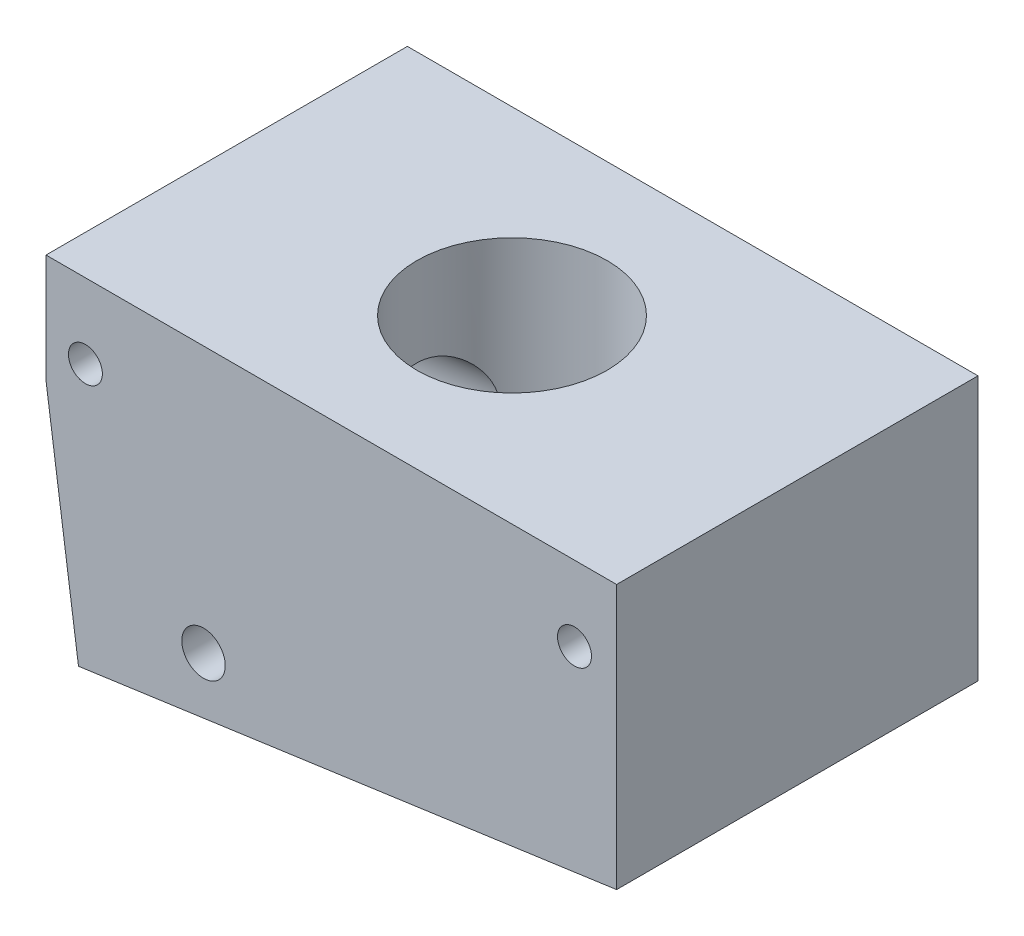
ISO-10303-21;
HEADER;
FILE_DESCRIPTION(('STEP AP214'),'2;1');
FILE_NAME('part.step','',(''),(''),'','','');
FILE_SCHEMA(('AUTOMOTIVE_DESIGN { 1 0 10303 214 1 1 1 1 }'));
ENDSEC;
DATA;
#1=APPLICATION_CONTEXT('core data for automotive mechanical design processes');
#2=APPLICATION_PROTOCOL_DEFINITION('international standard','automotive_design',2000,#1);
#3=PRODUCT_CONTEXT('',#1,'mechanical');
#4=PRODUCT('Part','Part','',(#3));
#5=PRODUCT_RELATED_PRODUCT_CATEGORY('part','',(#4));
#6=PRODUCT_DEFINITION_FORMATION('','',#4);
#7=PRODUCT_DEFINITION_CONTEXT('part definition',#1,'design');
#8=PRODUCT_DEFINITION('design','',#6,#7);
#9=PRODUCT_DEFINITION_SHAPE('','',#8);
#10=(LENGTH_UNIT() NAMED_UNIT(*) SI_UNIT(.MILLI.,.METRE.));
#11=(NAMED_UNIT(*) PLANE_ANGLE_UNIT() SI_UNIT($,.RADIAN.));
#12=(NAMED_UNIT(*) SI_UNIT($,.STERADIAN.) SOLID_ANGLE_UNIT());
#13=UNCERTAINTY_MEASURE_WITH_UNIT(LENGTH_MEASURE(1.E-05),#10,'distance_accuracy_value','');
#14=(GEOMETRIC_REPRESENTATION_CONTEXT(3) GLOBAL_UNCERTAINTY_ASSIGNED_CONTEXT((#13)) GLOBAL_UNIT_ASSIGNED_CONTEXT((#10,
#11,#12)) REPRESENTATION_CONTEXT('',''));
#15=CARTESIAN_POINT('',(0.,0.,0.));
#16=DIRECTION('',(0.,0.,1.));
#17=DIRECTION('',(1.,0.,0.));
#18=AXIS2_PLACEMENT_3D('',#15,#16,#17);
#19=CARTESIAN_POINT('',(-70.6449450864006,-20.1462402080981,13.3));
#20=DIRECTION('',(-0.990268068741571,-0.139173100960062,0.));
#21=DIRECTION('',(0.139173100960062,-0.990268068741571,0.));
#22=AXIS2_PLACEMENT_3D('',#19,#20,#21);
#23=CYLINDRICAL_SURFACE('',#22,4.49999999999999);
#24=CARTESIAN_POINT('',(-70.6449450864006,-20.1462402080981,13.3));
#25=DIRECTION('',(-0.990268068741571,-0.139173100960062,0.));
#26=DIRECTION('',(0.139173100960062,-0.990268068741571,0.));
#27=AXIS2_PLACEMENT_3D('',#24,#25,#26);
#28=CIRCLE('',#27,4.49999999999999);
#29=CARTESIAN_POINT('',(-70.0186661320803,-24.6024465174351,13.3));
#30=VERTEX_POINT('',#29);
#31=EDGE_CURVE('E211',#30,#30,#28,.T.);
#32=ORIENTED_EDGE('',*,*,#31,.T.);
#33=EDGE_LOOP('',(#32));
#34=FACE_BOUND('',#33,.T.);
#35=CARTESIAN_POINT('',(-61.7951592287187,-23.4467079930558,13.3));
#36=CARTESIAN_POINT('',(-61.7951604435383,-23.4467095598353,13.4088646906607));
#37=CARTESIAN_POINT('',(-61.7926143042912,-23.4423556324085,13.5177143788517));
#38=CARTESIAN_POINT('',(-61.782502355978,-23.4250257901873,13.734527313487));
#39=CARTESIAN_POINT('',(-61.7749349747786,-23.4120471750315,13.842490271578));
#40=CARTESIAN_POINT('',(-61.7549691167927,-23.3776828591857,14.0567219517486));
#41=CARTESIAN_POINT('',(-61.7425659372059,-23.3562889744895,14.162988919444));
#42=CARTESIAN_POINT('',(-61.713252046352,-23.3054697683965,14.3729663779708));
#43=CARTESIAN_POINT('',(-61.6963393445591,-23.2760409001796,14.4766757177134));
#44=CARTESIAN_POINT('',(-61.6396733021754,-23.1768044344509,14.7815653120615));
#45=CARTESIAN_POINT('',(-61.5938356782872,-23.0957841711633,14.9780859292963));
#46=CARTESIAN_POINT('',(-61.4897368663304,-22.9079478026812,15.3544861292814));
#47=CARTESIAN_POINT('',(-61.4314745969379,-22.8011294521575,15.534364261672));
#48=CARTESIAN_POINT('',(-61.3003810293889,-22.5538968437765,15.8926762300728));
#49=CARTESIAN_POINT('',(-61.2266789577439,-22.4112056961031,16.0692105664642));
#50=CARTESIAN_POINT('',(-61.0743423269966,-22.1032559194024,16.399182204132));
#51=CARTESIAN_POINT('',(-60.9957024740817,-21.9379728381855,16.5525940954574));
#52=CARTESIAN_POINT('',(-60.869670333559,-21.656554344579,16.779941417782));
#53=CARTESIAN_POINT('',(-60.822103030141,-21.5465244236298,16.861471262419));
#54=CARTESIAN_POINT('',(-60.7283993228048,-21.3196585935818,17.0154787295046));
#55=CARTESIAN_POINT('',(-60.6822632302036,-21.2028212194143,17.0879543927229));
#56=CARTESIAN_POINT('',(-60.5928244349399,-20.9628225160916,17.2234766393125));
#57=CARTESIAN_POINT('',(-60.5495204556348,-20.8396640816172,17.2865274878532));
#58=CARTESIAN_POINT('',(-60.4672235259846,-20.5874036524258,17.402774072952));
#59=CARTESIAN_POINT('',(-60.4282313095296,-20.4583006511852,17.4559681328583));
#60=CARTESIAN_POINT('',(-60.3366512824252,-20.1229205318468,17.5779042040824));
#61=CARTESIAN_POINT('',(-60.2881472931658,-19.9127367493303,17.6394494608499));
#62=CARTESIAN_POINT('',(-60.2309215762563,-19.5903345561735,17.7106005313251));
#63=CARTESIAN_POINT('',(-60.2144372607735,-19.4817121238631,17.730786947981));
#64=CARTESIAN_POINT('',(-60.1873496212365,-19.2626301698351,17.7637141907257));
#65=CARTESIAN_POINT('',(-60.1767436470567,-19.1521714991186,17.7764583721279));
#66=CARTESIAN_POINT('',(-60.1619419227022,-18.9291668583866,17.794194026826));
#67=CARTESIAN_POINT('',(-60.1578062232669,-18.816611033034,17.7991128801071));
#68=CARTESIAN_POINT('',(-60.1565015929565,-18.5913921997807,17.8006677973157));
#69=CARTESIAN_POINT('',(-60.1593325471758,-18.4787291936784,17.7973039978543));
#70=CARTESIAN_POINT('',(-60.1720057009548,-18.2543747823547,17.7821444181708));
#71=CARTESIAN_POINT('',(-60.1818474986015,-18.1426833218085,17.7703491213038));
#72=CARTESIAN_POINT('',(-60.2082348555533,-17.9213226439936,17.7383600887269));
#73=CARTESIAN_POINT('',(-60.224780061647,-17.811653320494,17.718166795517));
#74=CARTESIAN_POINT('',(-60.2615191388135,-17.6087144109905,17.6726022436824));
#75=CARTESIAN_POINT('',(-60.2810048080834,-17.5150994417144,17.6481853426758));
#76=CARTESIAN_POINT('',(-60.3240823289037,-17.3306244048042,17.5932769722023));
#77=CARTESIAN_POINT('',(-60.3476755157693,-17.2397652443714,17.5627835268406));
#78=CARTESIAN_POINT('',(-60.4236754578473,-16.97195907053,17.4625511856442));
#79=CARTESIAN_POINT('',(-60.481318963467,-16.7996981388874,17.384040916594));
#80=CARTESIAN_POINT('',(-60.6117602673321,-16.4524247578802,17.1963489167592));
#81=CARTESIAN_POINT('',(-60.6855190076381,-16.2790828081493,17.0847871800578));
#82=CARTESIAN_POINT('',(-60.8368924711959,-15.9517433721302,16.838132737509));
#83=CARTESIAN_POINT('',(-60.9145096607689,-15.7977584866393,16.7030248390458));
#84=CARTESIAN_POINT('',(-61.0366786172912,-15.5687442317799,16.4706567507527));
#85=CARTESIAN_POINT('',(-61.0818873966835,-15.4870003547944,16.3802372959811));
#86=CARTESIAN_POINT('',(-61.1705380217256,-15.331095020132,16.1922870712441));
#87=CARTESIAN_POINT('',(-61.2139803343102,-15.2569315507568,16.0947581998168));
#88=CARTESIAN_POINT('',(-61.298120242607,-15.1164615176993,15.8929636668466));
#89=CARTESIAN_POINT('',(-61.3388157988787,-15.0501607649512,15.7886931097253));
#90=CARTESIAN_POINT('',(-61.4164705650532,-14.9258863240237,15.5740393019983));
#91=CARTESIAN_POINT('',(-61.453431451866,-14.8679088936107,15.463658829586));
#92=CARTESIAN_POINT('',(-61.5235945035398,-14.759384512484,15.2346420683274));
#93=CARTESIAN_POINT('',(-61.5566856314013,-14.7090484357518,15.115871466798));
#94=CARTESIAN_POINT('',(-61.6171943645121,-14.6180015601282,14.873354984208));
#95=CARTESIAN_POINT('',(-61.644614533393,-14.5772864107781,14.7496113816068));
#96=CARTESIAN_POINT('',(-61.693053768082,-14.5059173395687,14.4980993854212));
#97=CARTESIAN_POINT('',(-61.714076163486,-14.4752581836164,14.3703331236875));
#98=CARTESIAN_POINT('',(-61.7491493950522,-14.4243582855182,14.1118062351339));
#99=CARTESIAN_POINT('',(-61.7632010983426,-14.4041162475096,13.9810459828735));
#100=CARTESIAN_POINT('',(-61.7828749808254,-14.3758403834713,13.7311629443279));
#101=CARTESIAN_POINT('',(-61.7892101736357,-14.3667727950232,13.6122119356744));
#102=CARTESIAN_POINT('',(-61.7957856625716,-14.3573621004427,13.3737998058631));
#103=CARTESIAN_POINT('',(-61.7960263465884,-14.3570184390672,13.2543387176539));
#104=CARTESIAN_POINT('',(-61.7904074296577,-14.3650587120021,13.0158795619416));
#105=CARTESIAN_POINT('',(-61.7845489924966,-14.373440981299,12.8968814104527));
#106=CARTESIAN_POINT('',(-61.7668742274746,-14.3988319521068,12.6602601094373));
#107=CARTESIAN_POINT('',(-61.7550579530776,-14.4158405762072,12.5426369475817));
#108=CARTESIAN_POINT('',(-61.7264940198362,-14.4572083679251,12.3156202520235));
#109=CARTESIAN_POINT('',(-61.7100301768613,-14.4811460775256,12.2061139232732));
#110=CARTESIAN_POINT('',(-61.6723292734832,-14.5363915896355,11.9898051160891));
#111=CARTESIAN_POINT('',(-61.6510906838288,-14.56770175354,11.8830035161438));
#112=CARTESIAN_POINT('',(-61.5808275200311,-14.6722964441462,11.5676799003671));
#113=CARTESIAN_POINT('',(-61.5252298847725,-14.7562812348267,11.3640434350038));
#114=CARTESIAN_POINT('',(-61.3968601270556,-14.9563166516566,10.9623123822942));
#115=CARTESIAN_POINT('',(-61.3232455149178,-15.0740144088316,10.7653186341956));
#116=CARTESIAN_POINT('',(-61.1667048516884,-15.3364343952181,10.3941394184212));
#117=CARTESIAN_POINT('',(-61.0837693469619,-15.4811841621214,10.2199775026289));
#118=CARTESIAN_POINT('',(-60.9065063778418,-15.8120420226377,9.88068353468433));
#119=CARTESIAN_POINT('',(-60.8118883844101,-16.0008803300557,9.71835262065687));
#120=CARTESIAN_POINT('',(-60.6299259471343,-16.4069614209923,9.42899378796106));
#121=CARTESIAN_POINT('',(-60.5425744552945,-16.6241761429677,9.30193137501221));
#122=CARTESIAN_POINT('',(-60.4043184048102,-17.03432569713,9.11094607893179));
#123=CARTESIAN_POINT('',(-60.3496173715876,-17.2223395723906,9.03930963033842));
#124=CARTESIAN_POINT('',(-60.2812759507209,-17.5134305945277,8.952142015136));
#125=CARTESIAN_POINT('',(-60.260783091858,-17.6119530482325,8.92647027275395));
#126=CARTESIAN_POINT('',(-60.2249769759887,-17.8114624572079,8.88209343285216));
#127=CARTESIAN_POINT('',(-60.2096617061445,-17.9124484383504,8.86338562774793));
#128=CARTESIAN_POINT('',(-60.1846449601877,-18.1166028013696,8.83302864526773));
#129=CARTESIAN_POINT('',(-60.1749673281648,-18.2197785670061,8.82140943910098));
#130=CARTESIAN_POINT('',(-60.1615899876142,-18.4270727340516,8.8053887685724));
#131=CARTESIAN_POINT('',(-60.1578902689594,-18.5311911338635,8.80098729198301));
#132=CARTESIAN_POINT('',(-60.1564826561877,-18.7395499359277,8.79930961433673));
#133=CARTESIAN_POINT('',(-60.1587762301103,-18.8437903618188,8.80203515902297));
#134=CARTESIAN_POINT('',(-60.1691150599204,-19.05158706797,8.81439485648143));
#135=CARTESIAN_POINT('',(-60.1771626736434,-19.1551430502034,8.82403184136252));
#136=CARTESIAN_POINT('',(-60.2082852286066,-19.453716109813,8.86162769078791));
#137=CARTESIAN_POINT('',(-60.238367178427,-19.6469906290363,8.89827207249072));
#138=CARTESIAN_POINT('',(-60.3137127527436,-20.0249156833404,8.99312383098931));
#139=CARTESIAN_POINT('',(-60.3589879324181,-20.2095595322413,9.05134762349097));
#140=CARTESIAN_POINT('',(-60.4852363674552,-20.6572474282288,9.22090927036609));
#141=CARTESIAN_POINT('',(-60.5727972319848,-20.9139790957858,9.34427751762735));
#142=CARTESIAN_POINT('',(-60.7119287081042,-21.278645909727,9.55845464781436));
#143=CARTESIAN_POINT('',(-60.7596836212332,-21.3969623872555,9.63484102169131));
#144=CARTESIAN_POINT('',(-60.8564156616094,-21.6264035498107,9.79713306140822));
#145=CARTESIAN_POINT('',(-60.9053926363982,-21.7375291257845,9.88303754437082));
#146=CARTESIAN_POINT('',(-61.0037485612911,-21.9532016993386,10.0651500891634));
#147=CARTESIAN_POINT('',(-61.0531258446877,-22.0576607497293,10.1614630776249));
#148=CARTESIAN_POINT('',(-61.1504039300666,-22.2579278449994,10.3634319630805));
#149=CARTESIAN_POINT('',(-61.1983045438572,-22.3537347902027,10.4690890443334));
#150=CARTESIAN_POINT('',(-61.2912080803117,-22.5356018704115,10.68933122559));
#151=CARTESIAN_POINT('',(-61.336216383584,-22.621680344068,10.8038988162379));
#152=CARTESIAN_POINT('',(-61.4220756559328,-22.7831498179341,11.0416851613074));
#153=CARTESIAN_POINT('',(-61.4629283830713,-22.8585453430312,11.1649002197253));
#154=CARTESIAN_POINT('',(-61.5566197506501,-23.0292592884196,11.4779063513227));
#155=CARTESIAN_POINT('',(-61.6064053257304,-23.117938942271,11.6723919064172));
#156=CARTESIAN_POINT('',(-61.6692579605084,-23.2286809908977,11.974336815245));
#157=CARTESIAN_POINT('',(-61.688231100788,-23.2618706475324,12.0766321545474));
#158=CARTESIAN_POINT('',(-61.7218492259856,-23.3204176282241,12.2841309470168));
#159=CARTESIAN_POINT('',(-61.7364954972304,-23.3457772801497,12.3893335257049));
#160=CARTESIAN_POINT('',(-61.7640302403324,-23.3933173671811,12.6273837505349));
#161=CARTESIAN_POINT('',(-61.7756611335205,-23.4132879072175,12.7608270805515));
#162=CARTESIAN_POINT('',(-61.7912257107898,-23.4399836883548,13.0295210652593));
#163=CARTESIAN_POINT('',(-61.7951577197124,-23.4467060468575,13.1647721068366));
#164=CARTESIAN_POINT('',(-61.7951592287187,-23.4467079930558,13.3));
#165=B_SPLINE_CURVE_WITH_KNOTS('',3,(#35,#36,#37,#38,#39,#40,#41,#42,#43,#44,#45,#46,#47,#48,
#49,#50,#51,#52,#53,#54,#55,#56,#57,#58,#59,#60,#61,#62,#63,#64,#65,#66,#67,#68,#69,#70,#71,#72,
#73,#74,#75,#76,#77,#78,#79,#80,#81,#82,#83,#84,#85,#86,#87,#88,#89,#90,#91,#92,#93,#94,#95,#96,
#97,#98,#99,#100,#101,#102,#103,#104,#105,#106,#107,#108,#109,#110,#111,#112,#113,#114,#115,
#116,#117,#118,#119,#120,#121,#122,#123,#124,#125,#126,#127,#128,#129,#130,#131,#132,#133,#134,
#135,#136,#137,#138,#139,#140,#141,#142,#143,#144,#145,#146,#147,#148,#149,#150,#151,#152,#153,
#154,#155,#156,#157,#158,#159,#160,#161,#162,#163,#164),.UNSPECIFIED.,.T.,.F.,(4,2,2,2,2,2,2,2,
2,2,2,2,2,2,2,2,2,2,2,2,2,2,2,2,2,2,2,2,2,2,2,2,2,2,2,2,2,2,2,2,2,2,2,2,2,2,2,2,2,2,2,2,2,2,2,2,
2,2,2,2,2,2,2,2,4),(0.,0.326452002498654,0.653006264229783,0.979878894373548,1.30689604728142,
1.95616918589538,2.60549885419069,3.3189986800328,4.03327696335742,4.46779526277689,
4.90240742515272,5.33682230584079,5.77131101332889,6.44126416878187,6.77604552009324,
7.11067581930263,7.44839378450053,7.78610617953614,8.12379921597875,8.46147446124582,
8.75721839664932,9.05305865576002,9.64447529808369,10.2990467628838,10.9540421490906,
11.3436913711733,11.7332369176941,12.12306858671,12.5127244315945,12.9116994760331,
13.3104937624059,13.7090801477769,14.107616938033,14.4655462291459,14.8234527394309,
15.1812909693259,15.5391259881357,15.8786192689443,16.2182214376291,16.8968309662612,
17.6169484098296,18.3378029322988,19.1332799881228,19.9279762656906,20.5506639693366,
20.8618895279821,21.1729939551774,21.4854048039744,21.7978151235155,22.1103019742239,
22.4229169462483,23.0174676837545,23.612471634263,24.5013064459366,24.9470957781297,
25.39282977119,25.8435720773044,26.2943715920362,26.7443066311145,27.1940505215883,
27.8493021168493,28.1765884320286,28.5037773507406,28.909196353377,29.3147035591472),.UNSPECIFIED.);
#166=CARTESIAN_POINT('',(-61.7951592287187,-23.4467079930558,13.3));
#167=VERTEX_POINT('',#166);
#168=EDGE_CURVE('E47',#167,#167,#165,.T.);
#169=ORIENTED_EDGE('',*,*,#168,.F.);
#170=EDGE_LOOP('',(#169));
#171=FACE_BOUND('',#170,.T.);
#172=ADVANCED_FACE('F43',(#34,#171),#23,.F.);
#173=CARTESIAN_POINT('',(0.,0.,26.6));
#174=DIRECTION('',(0.,0.,-1.));
#175=DIRECTION('',(-1.,0.,0.));
#176=AXIS2_PLACEMENT_3D('',#173,#174,#175);
#177=PLANE('',#176);
#178=DIRECTION('',(0.990268068741571,0.139173100960063,0.));
#179=VECTOR('',#178,1.);
#180=CARTESIAN_POINT('',(-73.4032395640249,-32.8537896010655,26.6));
#181=LINE('',#180,#179);
#182=CARTESIAN_POINT('',(-73.4032395640249,-32.8537896010655,26.6));
#183=VERTEX_POINT('',#182);
#184=CARTESIAN_POINT('',(-33.7951592287187,-27.2872369297823,26.6));
#185=VERTEX_POINT('',#184);
#186=EDGE_CURVE('E147',#183,#185,#181,.T.);
#187=ORIENTED_EDGE('',*,*,#186,.T.);
#188=DIRECTION('',(0.,1.,0.));
#189=VECTOR('',#188,1.);
#190=CARTESIAN_POINT('',(-33.7951592287187,-7.83439684052749,26.6));
#191=LINE('',#190,#189);
#192=CARTESIAN_POINT('',(-33.7951592287187,-7.83439684052749,26.6));
#193=VERTEX_POINT('',#192);
#194=EDGE_CURVE('E104',#185,#193,#191,.T.);
#195=ORIENTED_EDGE('',*,*,#194,.T.);
#196=DIRECTION('',(-1.,0.,0.));
#197=VECTOR('',#196,1.);
#198=CARTESIAN_POINT('',(-33.7951592287187,-7.83439684052749,26.6));
#199=LINE('',#198,#197);
#200=CARTESIAN_POINT('',(-75.7951592287187,-7.83439684052752,26.6));
#201=VERTEX_POINT('',#200);
#202=EDGE_CURVE('E109',#193,#201,#199,.T.);
#203=ORIENTED_EDGE('',*,*,#202,.T.);
#204=DIRECTION('',(0.,-1.,0.));
#205=VECTOR('',#204,1.);
#206=CARTESIAN_POINT('',(-75.7951592287187,-7.83439684052752,26.6));
#207=LINE('',#206,#205);
#208=CARTESIAN_POINT('',(-75.7951592287187,-15.8343968405275,26.6));
#209=VERTEX_POINT('',#208);
#210=EDGE_CURVE('E114',#201,#209,#207,.T.);
#211=ORIENTED_EDGE('',*,*,#210,.T.);
#212=DIRECTION('',(0.139173100960062,-0.990268068741571,0.));
#213=VECTOR('',#212,1.);
#214=CARTESIAN_POINT('',(-75.7951592287187,-15.8343968405275,26.6));
#215=LINE('',#214,#213);
#216=EDGE_CURVE('E73',#209,#183,#215,.T.);
#217=ORIENTED_EDGE('',*,*,#216,.T.);
#218=EDGE_LOOP('',(#187,#195,#203,#211,#217));
#219=FACE_BOUND('',#218,.T.);
#220=CARTESIAN_POINT('',(-36.8949306004272,-13.3343968405275,26.6));
#221=DIRECTION('',(0.,0.,1.));
#222=DIRECTION('',(-1.,0.,0.));
#223=AXIS2_PLACEMENT_3D('',#220,#221,#222);
#224=CIRCLE('',#223,1.25);
#225=CARTESIAN_POINT('',(-38.1449306004272,-13.3343968405275,26.6));
#226=VERTEX_POINT('',#225);
#227=EDGE_CURVE('E141',#226,#226,#224,.T.);
#228=ORIENTED_EDGE('',*,*,#227,.F.);
#229=EDGE_LOOP('',(#228));
#230=FACE_BOUND('',#229,.T.);
#231=CARTESIAN_POINT('',(-72.8952767241745,-13.3343968405275,26.6));
#232=DIRECTION('',(0.,0.,1.));
#233=DIRECTION('',(-1.,0.,0.));
#234=AXIS2_PLACEMENT_3D('',#231,#232,#233);
#235=CIRCLE('',#234,1.25);
#236=CARTESIAN_POINT('',(-74.1452767241745,-13.3343968405275,26.6));
#237=VERTEX_POINT('',#236);
#238=EDGE_CURVE('E227',#237,#237,#235,.T.);
#239=ORIENTED_EDGE('',*,*,#238,.F.);
#240=EDGE_LOOP('',(#239));
#241=FACE_BOUND('',#240,.T.);
#242=CARTESIAN_POINT('',(-64.2006500751101,-27.4176580934358,26.6));
#243=DIRECTION('',(0.,0.,1.));
#244=DIRECTION('',(-1.,0.,0.));
#245=AXIS2_PLACEMENT_3D('',#242,#243,#244);
#246=CIRCLE('',#245,1.6);
#247=CARTESIAN_POINT('',(-65.8006500751101,-27.4176580934358,26.6));
#248=VERTEX_POINT('',#247);
#249=EDGE_CURVE('E222',#248,#248,#246,.T.);
#250=ORIENTED_EDGE('',*,*,#249,.F.);
#251=EDGE_LOOP('',(#250));
#252=FACE_BOUND('',#251,.T.);
#253=ADVANCED_FACE('F111',(#219,#230,#241,#252),#177,.F.);
#254=CARTESIAN_POINT('',(0.,0.,0.));
#255=DIRECTION('',(0.,0.,-1.));
#256=DIRECTION('',(-1.,0.,0.));
#257=AXIS2_PLACEMENT_3D('',#254,#255,#256);
#258=PLANE('',#257);
#259=CARTESIAN_POINT('',(-72.8952767241745,-13.3343968405275,0.));
#260=DIRECTION('',(0.,0.,1.));
#261=DIRECTION('',(-1.,0.,0.));
#262=AXIS2_PLACEMENT_3D('',#259,#260,#261);
#263=CIRCLE('',#262,1.25);
#264=CARTESIAN_POINT('',(-74.1452767241745,-13.3343968405275,0.));
#265=VERTEX_POINT('',#264);
#266=EDGE_CURVE('E224',#265,#265,#263,.T.);
#267=ORIENTED_EDGE('',*,*,#266,.T.);
#268=EDGE_LOOP('',(#267));
#269=FACE_BOUND('',#268,.T.);
#270=DIRECTION('',(0.990268068741571,0.139173100960063,0.));
#271=VECTOR('',#270,1.);
#272=CARTESIAN_POINT('',(-73.4032395640249,-32.8537896010655,0.));
#273=LINE('',#272,#271);
#274=CARTESIAN_POINT('',(-73.4032395640249,-32.8537896010655,0.));
#275=VERTEX_POINT('',#274);
#276=CARTESIAN_POINT('',(-33.7951592287187,-27.2872369297823,0.));
#277=VERTEX_POINT('',#276);
#278=EDGE_CURVE('E137',#275,#277,#273,.T.);
#279=ORIENTED_EDGE('',*,*,#278,.F.);
#280=DIRECTION('',(0.139173100960062,-0.990268068741571,0.));
#281=VECTOR('',#280,1.);
#282=CARTESIAN_POINT('',(-75.7951592287187,-15.8343968405275,0.));
#283=LINE('',#282,#281);
#284=CARTESIAN_POINT('',(-75.7951592287187,-15.8343968405275,0.));
#285=VERTEX_POINT('',#284);
#286=EDGE_CURVE('E96',#285,#275,#283,.T.);
#287=ORIENTED_EDGE('',*,*,#286,.F.);
#288=DIRECTION('',(0.,-1.,0.));
#289=VECTOR('',#288,1.);
#290=CARTESIAN_POINT('',(-75.7951592287187,-7.83439684052752,0.));
#291=LINE('',#290,#289);
#292=CARTESIAN_POINT('',(-75.7951592287187,-7.83439684052752,0.));
#293=VERTEX_POINT('',#292);
#294=EDGE_CURVE('E144',#293,#285,#291,.T.);
#295=ORIENTED_EDGE('',*,*,#294,.F.);
#296=DIRECTION('',(-1.,0.,0.));
#297=VECTOR('',#296,1.);
#298=CARTESIAN_POINT('',(-33.7951592287187,-7.83439684052749,0.));
#299=LINE('',#298,#297);
#300=CARTESIAN_POINT('',(-33.7951592287187,-7.83439684052749,0.));
#301=VERTEX_POINT('',#300);
#302=EDGE_CURVE('E123',#301,#293,#299,.T.);
#303=ORIENTED_EDGE('',*,*,#302,.F.);
#304=DIRECTION('',(0.,1.,0.));
#305=VECTOR('',#304,1.);
#306=CARTESIAN_POINT('',(-33.7951592287187,-7.83439684052749,0.));
#307=LINE('',#306,#305);
#308=EDGE_CURVE('E140',#277,#301,#307,.T.);
#309=ORIENTED_EDGE('',*,*,#308,.F.);
#310=EDGE_LOOP('',(#279,#287,#295,#303,#309));
#311=FACE_BOUND('',#310,.T.);
#312=CARTESIAN_POINT('',(-36.8949306004272,-13.3343968405275,0.));
#313=DIRECTION('',(0.,0.,1.));
#314=DIRECTION('',(-1.,0.,0.));
#315=AXIS2_PLACEMENT_3D('',#312,#313,#314);
#316=CIRCLE('',#315,1.25);
#317=CARTESIAN_POINT('',(-38.1449306004272,-13.3343968405275,0.));
#318=VERTEX_POINT('',#317);
#319=EDGE_CURVE('E230',#318,#318,#316,.T.);
#320=ORIENTED_EDGE('',*,*,#319,.T.);
#321=EDGE_LOOP('',(#320));
#322=FACE_BOUND('',#321,.T.);
#323=CARTESIAN_POINT('',(-64.2006500751101,-27.4176580934358,0.));
#324=DIRECTION('',(0.,0.,1.));
#325=DIRECTION('',(-1.,0.,0.));
#326=AXIS2_PLACEMENT_3D('',#323,#324,#325);
#327=CIRCLE('',#326,1.6);
#328=CARTESIAN_POINT('',(-65.8006500751101,-27.4176580934358,0.));
#329=VERTEX_POINT('',#328);
#330=EDGE_CURVE('E221',#329,#329,#327,.T.);
#331=ORIENTED_EDGE('',*,*,#330,.T.);
#332=EDGE_LOOP('',(#331));
#333=FACE_BOUND('',#332,.T.);
#334=ADVANCED_FACE('F184',(#269,#311,#322,#333),#258,.T.);
#335=CARTESIAN_POINT('',(-73.4032395640249,-32.8537896010655,26.6));
#336=DIRECTION('',(-0.139173100960063,0.990268068741571,0.));
#337=DIRECTION('',(-0.990268068741571,-0.139173100960063,0.));
#338=AXIS2_PLACEMENT_3D('',#335,#336,#337);
#339=PLANE('',#338);
#340=ORIENTED_EDGE('',*,*,#278,.T.);
#341=DIRECTION('',(0.,0.,-1.));
#342=VECTOR('',#341,1.);
#343=CARTESIAN_POINT('',(-33.7951592287187,-27.2872369297823,26.6));
#344=LINE('',#343,#342);
#345=EDGE_CURVE('E12',#185,#277,#344,.T.);
#346=ORIENTED_EDGE('',*,*,#345,.F.);
#347=ORIENTED_EDGE('',*,*,#186,.F.);
#348=DIRECTION('',(0.,0.,-1.));
#349=VECTOR('',#348,1.);
#350=CARTESIAN_POINT('',(-73.4032395640249,-32.8537896010655,26.6));
#351=LINE('',#350,#349);
#352=EDGE_CURVE('E133',#183,#275,#351,.T.);
#353=ORIENTED_EDGE('',*,*,#352,.T.);
#354=EDGE_LOOP('',(#340,#346,#347,#353));
#355=FACE_BOUND('',#354,.T.);
#356=ADVANCED_FACE('F45',(#355),#339,.F.);
#357=CARTESIAN_POINT('',(-33.7951592287187,-7.83439684052749,26.6));
#358=DIRECTION('',(-1.,0.,0.));
#359=DIRECTION('',(0.,-1.,0.));
#360=AXIS2_PLACEMENT_3D('',#357,#358,#359);
#361=PLANE('',#360);
#362=ORIENTED_EDGE('',*,*,#308,.T.);
#363=DIRECTION('',(0.,0.,-1.));
#364=VECTOR('',#363,1.);
#365=CARTESIAN_POINT('',(-33.7951592287187,-7.83439684052749,26.6));
#366=LINE('',#365,#364);
#367=EDGE_CURVE('E57',#193,#301,#366,.T.);
#368=ORIENTED_EDGE('',*,*,#367,.F.);
#369=ORIENTED_EDGE('',*,*,#194,.F.);
#370=ORIENTED_EDGE('',*,*,#345,.T.);
#371=EDGE_LOOP('',(#362,#368,#369,#370));
#372=FACE_BOUND('',#371,.T.);
#373=ADVANCED_FACE('F241',(#372),#361,.F.);
#374=CARTESIAN_POINT('',(-33.7951592287187,-7.83439684052749,26.6));
#375=DIRECTION('',(0.,-1.,0.));
#376=DIRECTION('',(1.,0.,0.));
#377=AXIS2_PLACEMENT_3D('',#374,#375,#376);
#378=PLANE('',#377);
#379=CARTESIAN_POINT('',(-54.7951592287187,-7.8343968405275,13.3));
#380=DIRECTION('',(0.,1.,0.));
#381=DIRECTION('',(-1.,0.,0.));
#382=AXIS2_PLACEMENT_3D('',#379,#380,#381);
#383=CIRCLE('',#382,7.);
#384=CARTESIAN_POINT('',(-61.7951592287187,-7.83439684052751,13.3));
#385=VERTEX_POINT('',#384);
#386=EDGE_CURVE('E204',#385,#385,#383,.T.);
#387=ORIENTED_EDGE('',*,*,#386,.F.);
#388=EDGE_LOOP('',(#387));
#389=FACE_BOUND('',#388,.T.);
#390=ORIENTED_EDGE('',*,*,#302,.T.);
#391=DIRECTION('',(0.,0.,-1.));
#392=VECTOR('',#391,1.);
#393=CARTESIAN_POINT('',(-75.7951592287187,-7.83439684052752,26.6));
#394=LINE('',#393,#392);
#395=EDGE_CURVE('E120',#201,#293,#394,.T.);
#396=ORIENTED_EDGE('',*,*,#395,.F.);
#397=ORIENTED_EDGE('',*,*,#202,.F.);
#398=ORIENTED_EDGE('',*,*,#367,.T.);
#399=EDGE_LOOP('',(#390,#396,#397,#398));
#400=FACE_BOUND('',#399,.T.);
#401=ADVANCED_FACE('F121',(#389,#400),#378,.F.);
#402=CARTESIAN_POINT('',(-75.7951592287187,-7.83439684052752,26.6));
#403=DIRECTION('',(1.,0.,0.));
#404=DIRECTION('',(0.,0.,-1.));
#405=AXIS2_PLACEMENT_3D('',#402,#403,#404);
#406=PLANE('',#405);
#407=DIRECTION('',(0.,0.,-1.));
#408=VECTOR('',#407,1.);
#409=CARTESIAN_POINT('',(-75.7951592287187,-15.8343968405275,26.6));
#410=LINE('',#409,#408);
#411=CARTESIAN_POINT('',(-75.7951592287187,-15.8343968405275,9.96333983423476));
#412=VERTEX_POINT('',#411);
#413=EDGE_CURVE('E149',#412,#285,#410,.T.);
#414=ORIENTED_EDGE('',*,*,#413,.F.);
#415=CARTESIAN_POINT('',(-75.7951592287187,-20.8700556025555,13.3));
#416=DIRECTION('',(1.,0.,0.));
#417=DIRECTION('',(0.,-1.,0.));
#418=AXIS2_PLACEMENT_3D('',#415,#416,#417);
#419=ELLIPSE('',#418,6.0589654351117,6.);
#420=CARTESIAN_POINT('',(-75.7951592287187,-15.8343968405275,16.6366601657652));
#421=VERTEX_POINT('',#420);
#422=EDGE_CURVE('E64',#412,#421,#419,.T.);
#423=ORIENTED_EDGE('',*,*,#422,.T.);
#424=EDGE_CURVE('E127',#209,#421,#410,.T.);
#425=ORIENTED_EDGE('',*,*,#424,.F.);
#426=ORIENTED_EDGE('',*,*,#210,.F.);
#427=ORIENTED_EDGE('',*,*,#395,.T.);
#428=ORIENTED_EDGE('',*,*,#294,.T.);
#429=EDGE_LOOP('',(#414,#423,#425,#426,#427,#428));
#430=FACE_BOUND('',#429,.T.);
#431=ADVANCED_FACE('F130',(#430),#406,.F.);
#432=CARTESIAN_POINT('',(-75.7951592287187,-15.8343968405275,26.6));
#433=DIRECTION('',(0.990268068741571,0.139173100960062,0.));
#434=DIRECTION('',(-0.139173100960062,0.990268068741571,0.));
#435=AXIS2_PLACEMENT_3D('',#432,#433,#434);
#436=PLANE('',#435);
#437=ORIENTED_EDGE('',*,*,#424,.T.);
#438=CARTESIAN_POINT('',(-75.1011513957377,-20.7725191624183,13.3));
#439=DIRECTION('',(-0.990268068741571,-0.139173100960062,0.));
#440=DIRECTION('',(0.139173100960062,-0.990268068741571,0.));
#441=AXIS2_PLACEMENT_3D('',#438,#439,#440);
#442=CIRCLE('',#441,6.);
#443=EDGE_CURVE('E212',#412,#421,#442,.T.);
#444=ORIENTED_EDGE('',*,*,#443,.F.);
#445=ORIENTED_EDGE('',*,*,#413,.T.);
#446=ORIENTED_EDGE('',*,*,#286,.T.);
#447=ORIENTED_EDGE('',*,*,#352,.F.);
#448=ORIENTED_EDGE('',*,*,#216,.F.);
#449=EDGE_LOOP('',(#437,#444,#445,#446,#447,#448));
#450=FACE_BOUND('',#449,.T.);
#451=ADVANCED_FACE('F244',(#450),#436,.F.);
#452=CARTESIAN_POINT('',(-36.8949306004272,-13.3343968405275,26.6));
#453=DIRECTION('',(0.,0.,-1.));
#454=DIRECTION('',(-1.,0.,0.));
#455=AXIS2_PLACEMENT_3D('',#452,#453,#454);
#456=CYLINDRICAL_SURFACE('',#455,1.25);
#457=ORIENTED_EDGE('',*,*,#227,.T.);
#458=EDGE_LOOP('',(#457));
#459=FACE_BOUND('',#458,.T.);
#460=ORIENTED_EDGE('',*,*,#319,.F.);
#461=EDGE_LOOP('',(#460));
#462=FACE_BOUND('',#461,.T.);
#463=ADVANCED_FACE('F175',(#459,#462),#456,.F.);
#464=CARTESIAN_POINT('',(-72.8952767241745,-13.3343968405275,26.6));
#465=DIRECTION('',(0.,0.,-1.));
#466=DIRECTION('',(-1.,0.,0.));
#467=AXIS2_PLACEMENT_3D('',#464,#465,#466);
#468=CYLINDRICAL_SURFACE('',#467,1.25);
#469=CARTESIAN_POINT('',(-72.7213103479744,-14.5722319264545,14.8028569507209));
#470=CARTESIAN_POINT('',(-72.7011555379602,-14.569397848051,14.8028519220492));
#471=CARTESIAN_POINT('',(-72.6810382536902,-14.5660624270397,14.8009105280962));
#472=CARTESIAN_POINT('',(-72.6416379402755,-14.5585591990613,14.7933544999178));
#473=CARTESIAN_POINT('',(-72.6223577483126,-14.5543887950165,14.7877282774395));
#474=CARTESIAN_POINT('',(-72.5853518358164,-14.5455143148951,14.7734407902702));
#475=CARTESIAN_POINT('',(-72.567612266992,-14.5408161154126,14.7648110645469));
#476=CARTESIAN_POINT('',(-72.5336645666762,-14.5310792591112,14.7451380818627));
#477=CARTESIAN_POINT('',(-72.5174562936379,-14.5260406338338,14.7340950482916));
#478=CARTESIAN_POINT('',(-72.4753733864256,-14.5120943173058,14.7014902457849));
#479=CARTESIAN_POINT('',(-72.4509798505515,-14.5030224677077,14.6780948938173));
#480=CARTESIAN_POINT('',(-72.4060915398267,-14.4849545263732,14.6277909292476));
#481=CARTESIAN_POINT('',(-72.3856106921728,-14.4759588103281,14.6008703210558));
#482=CARTESIAN_POINT('',(-72.3317510969994,-14.4508414358242,14.5208005208005));
#483=CARTESIAN_POINT('',(-72.3022981892613,-14.4351962988634,14.4648890010764));
#484=CARTESIAN_POINT('',(-72.2511663482252,-14.4060639367195,14.349168089041));
#485=CARTESIAN_POINT('',(-72.2295079877055,-14.3925824734476,14.2893488668346));
#486=CARTESIAN_POINT('',(-72.1918388820408,-14.3679266133693,14.1669259556913));
#487=CARTESIAN_POINT('',(-72.1758799089376,-14.356773729812,14.1043022824461));
#488=CARTESIAN_POINT('',(-72.1485970117234,-14.337018620296,13.9776301265151));
#489=CARTESIAN_POINT('',(-72.1372775460885,-14.3284188500063,13.9135803353701));
#490=CARTESIAN_POINT('',(-72.1184866703636,-14.3138038293775,13.7845589475319));
#491=CARTESIAN_POINT('',(-72.1110198943867,-14.3077916929444,13.7195863368747));
#492=CARTESIAN_POINT('',(-72.0994739157185,-14.2983743173186,13.5891295080765));
#493=CARTESIAN_POINT('',(-72.0953963568022,-14.2949703431507,13.5236450572153));
#494=CARTESIAN_POINT('',(-72.0901278073333,-14.2905604708065,13.3857470423036));
#495=CARTESIAN_POINT('',(-72.0892756052974,-14.2898362011364,13.3133113717602));
#496=CARTESIAN_POINT('',(-72.0913285372009,-14.2915638787967,13.1685580615418));
#497=CARTESIAN_POINT('',(-72.0942323419912,-14.294014702548,13.0962403891761));
#498=CARTESIAN_POINT('',(-72.1040052417834,-14.3020906261412,12.9520467793329));
#499=CARTESIAN_POINT('',(-72.1108739513434,-14.3077154174298,12.8801707996033));
#500=CARTESIAN_POINT('',(-72.1290984546992,-14.3221235036849,12.7373570615768));
#501=CARTESIAN_POINT('',(-72.1404513320938,-14.3309047454341,12.666418724387));
#502=CARTESIAN_POINT('',(-72.1705917683777,-14.353096087328,12.5159223126235));
#503=CARTESIAN_POINT('',(-72.1902123441527,-14.3669895634314,12.4365878647525));
#504=CARTESIAN_POINT('',(-72.2267870441129,-14.3907222991174,12.3206041846984));
#505=CARTESIAN_POINT('',(-72.2401383686688,-14.3990973677064,12.2825128342103));
#506=CARTESIAN_POINT('',(-72.2697285207053,-14.4167505597623,12.2076967246297));
#507=CARTESIAN_POINT('',(-72.2859647049023,-14.4260278530633,12.1709707514333));
#508=CARTESIAN_POINT('',(-72.3183516958592,-14.4434155724876,12.1067361501073));
#509=CARTESIAN_POINT('',(-72.3338558116651,-14.4513825824684,12.0788654324961));
#510=CARTESIAN_POINT('',(-72.3676221539169,-14.4677254313824,12.0248659075506));
#511=CARTESIAN_POINT('',(-72.3858892609068,-14.4761019756357,11.9987403029043));
#512=CARTESIAN_POINT('',(-72.4259468280453,-14.4931508868653,11.9488410293068));
#513=CARTESIAN_POINT('',(-72.4477770478966,-14.5018256008595,11.9250994518777));
#514=CARTESIAN_POINT('',(-72.4953685933906,-14.5189672412707,11.8818503290388));
#515=CARTESIAN_POINT('',(-72.5211139015279,-14.5274348581466,11.8623262827322));
#516=CARTESIAN_POINT('',(-72.5652330503435,-14.5401577570439,11.8364646422879));
#517=CARTESIAN_POINT('',(-72.5822732117921,-14.5447110715693,11.8280084479231));
#518=CARTESIAN_POINT('',(-72.6176058858456,-14.553301375588,11.8138970518281));
#519=CARTESIAN_POINT('',(-72.6358971241692,-14.5573388787809,11.8082390469792));
#520=CARTESIAN_POINT('',(-72.6734892846421,-14.5647135101148,11.8001930917575));
#521=CARTESIAN_POINT('',(-72.6927968149438,-14.5680450915063,11.7978302795991));
#522=CARTESIAN_POINT('',(-72.7316511655332,-14.5737966656236,11.796716429357));
#523=CARTESIAN_POINT('',(-72.7511979384555,-14.5762168358702,11.7979646875127));
#524=CARTESIAN_POINT('',(-72.7880204297275,-14.5799115124819,11.8036468826812));
#525=CARTESIAN_POINT('',(-72.8053372118982,-14.5812721784791,11.8077710693265));
#526=CARTESIAN_POINT('',(-72.8392093198512,-14.583254256862,11.8185273230967));
#527=CARTESIAN_POINT('',(-72.8557642696223,-14.5838753078856,11.8251606140393));
#528=CARTESIAN_POINT('',(-72.8954189133445,-14.5846197737861,11.8441227044755));
#529=CARTESIAN_POINT('',(-72.9179438061518,-14.584372848627,11.8576634649913));
#530=CARTESIAN_POINT('',(-72.9606406060758,-14.5828704636504,11.888002139191));
#531=CARTESIAN_POINT('',(-72.9808061702791,-14.5816123536006,11.9048085239272));
#532=CARTESIAN_POINT('',(-73.0314553955782,-14.5773638291501,11.9525435125651));
#533=CARTESIAN_POINT('',(-73.0599793524626,-14.5737781912453,11.985479072191));
#534=CARTESIAN_POINT('',(-73.1119543164773,-14.5657540665425,12.0549967841236));
#535=CARTESIAN_POINT('',(-73.1353922638233,-14.5613134381663,12.0915879799318));
#536=CARTESIAN_POINT('',(-73.177817945517,-14.5522358711783,12.1664543938815));
#537=CARTESIAN_POINT('',(-73.1968688630888,-14.5476030275299,12.2046948427486));
#538=CARTESIAN_POINT('',(-73.2316813680071,-14.5384122212133,12.2826669393266));
#539=CARTESIAN_POINT('',(-73.2474398227196,-14.5338543336261,12.3223999651443));
#540=CARTESIAN_POINT('',(-73.2906201228376,-14.52062158255,12.4432636995857));
#541=CARTESIAN_POINT('',(-73.3138818919383,-14.5124040060986,12.5259343050857));
#542=CARTESIAN_POINT('',(-73.3507487032855,-14.4986093533244,12.6881101481845));
#543=CARTESIAN_POINT('',(-73.3648603723908,-14.4929007945318,12.7674966318363));
#544=CARTESIAN_POINT('',(-73.3867830663649,-14.4837720063177,12.9273288151482));
#545=CARTESIAN_POINT('',(-73.3945885547193,-14.4803537881502,13.0077753826817));
#546=CARTESIAN_POINT('',(-73.4044791214533,-14.4759929636014,13.1691735803679));
#547=CARTESIAN_POINT('',(-73.4065574814636,-14.4750532647723,13.2501256921374));
#548=CARTESIAN_POINT('',(-73.4051162571567,-14.4756942643329,13.4119067999722));
#549=CARTESIAN_POINT('',(-73.4015999151145,-14.4772735029342,13.4927358401923));
#550=CARTESIAN_POINT('',(-73.3862671370735,-14.4839833901946,13.6850988564487));
#551=CARTESIAN_POINT('',(-73.3717661746216,-14.4902515082018,13.7964154994358));
#552=CARTESIAN_POINT('',(-73.3400029405975,-14.5026584321336,13.9609583750016));
#553=CARTESIAN_POINT('',(-73.3277794006061,-14.507283183312,14.0152991645102));
#554=CARTESIAN_POINT('',(-73.2994590605485,-14.5173454221569,14.1228753704834));
#555=CARTESIAN_POINT('',(-73.2833648583567,-14.5227823637818,14.1761115024383));
#556=CARTESIAN_POINT('',(-73.2493246697556,-14.5333200223345,14.2729778617114));
#557=CARTESIAN_POINT('',(-73.2320277771784,-14.5383470527935,14.3168423178806));
#558=CARTESIAN_POINT('',(-73.1933335525899,-14.5485076213605,14.4029128991601));
#559=CARTESIAN_POINT('',(-73.1719243734749,-14.5536414280192,14.4451137977397));
#560=CARTESIAN_POINT('',(-73.1237645738292,-14.563588156873,14.5272082519016));
#561=CARTESIAN_POINT('',(-73.0969465969244,-14.5683958933784,14.567063581369));
#562=CARTESIAN_POINT('',(-73.0368086314381,-14.5767282459971,14.6416668655192));
#563=CARTESIAN_POINT('',(-73.0035297540312,-14.5802605910721,14.6764447971031));
#564=CARTESIAN_POINT('',(-72.9496136231139,-14.5833262710283,14.7201602300045));
#565=CARTESIAN_POINT('',(-72.9320620863125,-14.5839903882724,14.7328042545987));
#566=CARTESIAN_POINT('',(-72.8953519003386,-14.5845315381844,14.7555658867373));
#567=CARTESIAN_POINT('',(-72.8761941358666,-14.5844090013623,14.7656848730025));
#568=CARTESIAN_POINT('',(-72.8390379250467,-14.5832510631099,14.7815634599507));
#569=CARTESIAN_POINT('',(-72.8212052283,-14.5823345819032,14.7877153959431));
#570=CARTESIAN_POINT('',(-72.7848594124425,-14.5796425854107,14.7970328885788));
#571=CARTESIAN_POINT('',(-72.7663483658981,-14.5778695131218,14.8002068630831));
#572=CARTESIAN_POINT('',(-72.7389612901718,-14.5746168609341,14.8024903717596));
#573=CARTESIAN_POINT('',(-72.7301322243633,-14.5734724188895,14.8028591517995));
#574=CARTESIAN_POINT('',(-72.7213103479744,-14.5722319264545,14.8028569507209));
#575=B_SPLINE_CURVE_WITH_KNOTS('',3,(#469,#470,#471,#472,#473,#474,#475,#476,#477,#478,#479,
#480,#481,#482,#483,#484,#485,#486,#487,#488,#489,#490,#491,#492,#493,#494,#495,#496,#497,#498,
#499,#500,#501,#502,#503,#504,#505,#506,#507,#508,#509,#510,#511,#512,#513,#514,#515,#516,#517,
#518,#519,#520,#521,#522,#523,#524,#525,#526,#527,#528,#529,#530,#531,#532,#533,#534,#535,#536,
#537,#538,#539,#540,#541,#542,#543,#544,#545,#546,#547,#548,#549,#550,#551,#552,#553,#554,#555,
#556,#557,#558,#559,#560,#561,#562,#563,#564,#565,#566,#567,#568,#569,#570,#571,#572,#573,#574),
.UNSPECIFIED.,.T.,.F.,(4,2,2,2,2,2,2,2,2,2,2,2,2,2,2,2,2,2,2,2,2,2,2,2,2,2,2,2,2,2,2,2,2,2,2,2,
2,2,2,2,2,2,2,2,2,2,2,2,2,2,2,2,4),(0.,0.0610242273877263,0.122241294661673,0.182834021993905,
0.243421142886152,0.347801059771798,0.452545862944646,0.646759973283329,0.841482992901189,
1.03793235603634,1.2345700630364,1.4314437427128,1.6284128507747,1.84557528232395,
2.06266088699407,2.27972539159029,2.49664895418927,2.74469696472026,2.86827010561952,
2.99173059975624,3.09022470586741,3.18889486870295,3.28875259022261,3.38821224785401,
3.44669012796617,3.50510930792005,3.56397175983051,3.62282274082421,3.67615434360838,
3.72951199253663,3.80791125361646,3.88651666536734,4.01693178583973,4.14767792244083,
4.27640325465409,4.40525051117276,4.66336585614691,4.90557975026322,5.14800606579753,
5.39071664553502,5.63328661942344,5.9696889607822,6.1372512439615,6.30470137659105,
6.44680396552078,6.58932225086115,6.73373908415237,6.87726543980303,6.94202176930832,
7.0067426628269,7.06317476430378,7.11944686318128,7.14615751886922),.UNSPECIFIED.);
#576=CARTESIAN_POINT('',(-72.7213103479744,-14.5722319264545,14.8028569507209));
#577=VERTEX_POINT('',#576);
#578=EDGE_CURVE('E151',#577,#577,#575,.T.);
#579=ORIENTED_EDGE('',*,*,#578,.F.);
#580=EDGE_LOOP('',(#579));
#581=FACE_BOUND('',#580,.T.);
#582=ORIENTED_EDGE('',*,*,#238,.T.);
#583=EDGE_LOOP('',(#582));
#584=FACE_BOUND('',#583,.T.);
#585=ORIENTED_EDGE('',*,*,#266,.F.);
#586=EDGE_LOOP('',(#585));
#587=FACE_BOUND('',#586,.T.);
#588=ADVANCED_FACE('F159',(#581,#584,#587),#468,.F.);
#589=CARTESIAN_POINT('',(-64.2006500751101,-27.4176580934358,26.6));
#590=DIRECTION('',(0.,0.,-1.));
#591=DIRECTION('',(-1.,0.,0.));
#592=AXIS2_PLACEMENT_3D('',#589,#590,#591);
#593=CYLINDRICAL_SURFACE('',#592,1.6);
#594=ORIENTED_EDGE('',*,*,#249,.T.);
#595=EDGE_LOOP('',(#594));
#596=FACE_BOUND('',#595,.T.);
#597=ORIENTED_EDGE('',*,*,#330,.F.);
#598=EDGE_LOOP('',(#597));
#599=FACE_BOUND('',#598,.T.);
#600=ADVANCED_FACE('F168',(#596,#599),#593,.F.);
#601=CARTESIAN_POINT('',(-70.6449450864006,-20.1462402080981,13.3));
#602=DIRECTION('',(-0.990268068741571,-0.139173100960062,0.));
#603=DIRECTION('',(0.139173100960062,-0.990268068741571,0.));
#604=AXIS2_PLACEMENT_3D('',#601,#602,#603);
#605=CYLINDRICAL_SURFACE('',#604,6.);
#606=ORIENTED_EDGE('',*,*,#578,.T.);
#607=EDGE_LOOP('',(#606));
#608=FACE_BOUND('',#607,.T.);
#609=CARTESIAN_POINT('',(-70.6449450864006,-20.1462402080981,13.3));
#610=DIRECTION('',(-0.990268068741571,-0.139173100960062,0.));
#611=DIRECTION('',(0.139173100960062,-0.990268068741571,0.));
#612=AXIS2_PLACEMENT_3D('',#609,#610,#611);
#613=CIRCLE('',#612,6.);
#614=CARTESIAN_POINT('',(-69.8099064806402,-26.0878486205475,13.3));
#615=VERTEX_POINT('',#614);
#616=EDGE_CURVE('E158',#615,#615,#613,.T.);
#617=ORIENTED_EDGE('',*,*,#616,.F.);
#618=EDGE_LOOP('',(#617));
#619=FACE_BOUND('',#618,.T.);
#620=ORIENTED_EDGE('',*,*,#443,.T.);
#621=ORIENTED_EDGE('',*,*,#422,.F.);
#622=EDGE_LOOP('',(#620,#621));
#623=FACE_BOUND('',#622,.T.);
#624=ADVANCED_FACE('F163',(#608,#619,#623),#605,.F.);
#625=CARTESIAN_POINT('',(-70.6449450864006,-20.1462402080981,13.3));
#626=DIRECTION('',(-0.990268068741571,-0.139173100960062,0.));
#627=DIRECTION('',(0.139173100960062,-0.990268068741571,0.));
#628=AXIS2_PLACEMENT_3D('',#625,#626,#627);
#629=PLANE('',#628);
#630=ORIENTED_EDGE('',*,*,#31,.F.);
#631=EDGE_LOOP('',(#630));
#632=FACE_BOUND('',#631,.T.);
#633=ORIENTED_EDGE('',*,*,#616,.T.);
#634=EDGE_LOOP('',(#633));
#635=FACE_BOUND('',#634,.T.);
#636=ADVANCED_FACE('F167',(#632,#635),#629,.T.);
#637=CARTESIAN_POINT('',(-54.7951592287187,-7.8343968405275,13.3));
#638=DIRECTION('',(0.,-1.,0.));
#639=DIRECTION('',(1.,0.,0.));
#640=AXIS2_PLACEMENT_3D('',#637,#638,#639);
#641=CYLINDRICAL_SURFACE('',#640,7.);
#642=ORIENTED_EDGE('',*,*,#386,.T.);
#643=EDGE_LOOP('',(#642));
#644=FACE_BOUND('',#643,.T.);
#645=CARTESIAN_POINT('',(-54.7951592287187,-23.8343968405275,13.3));
#646=DIRECTION('',(0.,1.,0.));
#647=DIRECTION('',(-1.,0.,0.));
#648=AXIS2_PLACEMENT_3D('',#645,#646,#647);
#649=CIRCLE('',#648,7.);
#650=CARTESIAN_POINT('',(-61.7951592287187,-23.8343968405275,13.3));
#651=VERTEX_POINT('',#650);
#652=EDGE_CURVE('E208',#651,#651,#649,.T.);
#653=ORIENTED_EDGE('',*,*,#652,.F.);
#654=EDGE_LOOP('',(#653));
#655=FACE_BOUND('',#654,.T.);
#656=ORIENTED_EDGE('',*,*,#168,.T.);
#657=EDGE_LOOP('',(#656));
#658=FACE_BOUND('',#657,.T.);
#659=ADVANCED_FACE('F192',(#644,#655,#658),#641,.F.);
#660=CARTESIAN_POINT('',(0.,-23.8343968405275,0.));
#661=DIRECTION('',(0.,-1.,0.));
#662=DIRECTION('',(0.,0.,-1.));
#663=AXIS2_PLACEMENT_3D('',#660,#661,#662);
#664=PLANE('',#663);
#665=ORIENTED_EDGE('',*,*,#652,.T.);
#666=EDGE_LOOP('',(#665));
#667=FACE_BOUND('',#666,.T.);
#668=ADVANCED_FACE('F190',(#667),#664,.F.);
#669=CLOSED_SHELL('',(#172,#253,#334,#356,#373,#401,#431,#451,#463,#588,#600,#624,#636,#659,#668));
#670=MANIFOLD_SOLID_BREP('B2',#669);
#671=ADVANCED_BREP_SHAPE_REPRESENTATION('',(#18,#670),#14);
#672=SHAPE_DEFINITION_REPRESENTATION(#9,#671);
ENDSEC;
END-ISO-10303-21;
